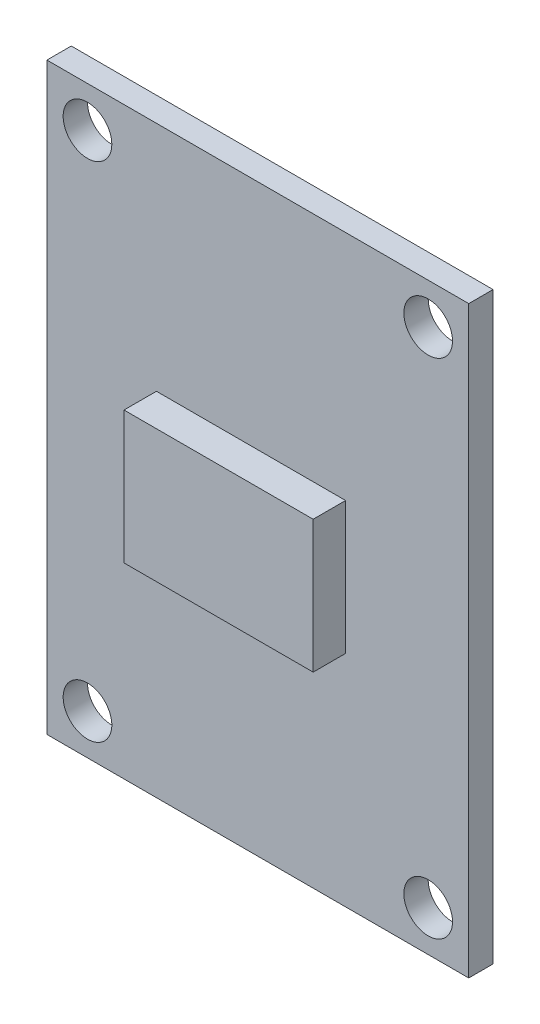
ISO-10303-21;
HEADER;
FILE_DESCRIPTION(('STEP AP214'),'2;1');
FILE_NAME('part.step','',(''),(''),'','','');
FILE_SCHEMA(('AUTOMOTIVE_DESIGN { 1 0 10303 214 1 1 1 1 }'));
ENDSEC;
DATA;
#1=APPLICATION_CONTEXT('core data for automotive mechanical design processes');
#2=APPLICATION_PROTOCOL_DEFINITION('international standard','automotive_design',2000,#1);
#3=PRODUCT_CONTEXT('',#1,'mechanical');
#4=PRODUCT('Part','Part','',(#3));
#5=PRODUCT_RELATED_PRODUCT_CATEGORY('part','',(#4));
#6=PRODUCT_DEFINITION_FORMATION('','',#4);
#7=PRODUCT_DEFINITION_CONTEXT('part definition',#1,'design');
#8=PRODUCT_DEFINITION('design','',#6,#7);
#9=PRODUCT_DEFINITION_SHAPE('','',#8);
#10=(LENGTH_UNIT() NAMED_UNIT(*) SI_UNIT(.MILLI.,.METRE.));
#11=(NAMED_UNIT(*) PLANE_ANGLE_UNIT() SI_UNIT($,.RADIAN.));
#12=(NAMED_UNIT(*) SI_UNIT($,.STERADIAN.) SOLID_ANGLE_UNIT());
#13=UNCERTAINTY_MEASURE_WITH_UNIT(LENGTH_MEASURE(1.E-05),#10,'distance_accuracy_value','');
#14=(GEOMETRIC_REPRESENTATION_CONTEXT(3) GLOBAL_UNCERTAINTY_ASSIGNED_CONTEXT((#13)) GLOBAL_UNIT_ASSIGNED_CONTEXT((#10,
#11,#12)) REPRESENTATION_CONTEXT('',''));
#15=CARTESIAN_POINT('',(0.,0.,0.));
#16=DIRECTION('',(0.,0.,1.));
#17=DIRECTION('',(1.,0.,0.));
#18=AXIS2_PLACEMENT_3D('',#15,#16,#17);
#19=CARTESIAN_POINT('',(0.,0.,1.5));
#20=DIRECTION('',(0.,0.,-1.));
#21=DIRECTION('',(-1.,0.,0.));
#22=AXIS2_PLACEMENT_3D('',#19,#20,#21);
#23=PLANE('',#22);
#24=CARTESIAN_POINT('',(114.872972656904,11.0024836270944,1.5));
#25=DIRECTION('',(0.,0.,1.));
#26=DIRECTION('',(-1.,0.,0.));
#27=AXIS2_PLACEMENT_3D('',#24,#25,#26);
#28=CIRCLE('',#27,1.5);
#29=CARTESIAN_POINT('',(113.372972656904,11.0024836270944,1.5));
#30=VERTEX_POINT('',#29);
#31=EDGE_CURVE('E120',#30,#30,#28,.T.);
#32=ORIENTED_EDGE('',*,*,#31,.F.);
#33=EDGE_LOOP('',(#32));
#34=FACE_BOUND('',#33,.T.);
#35=CARTESIAN_POINT('',(135.872972656904,11.0024836270944,1.5));
#36=DIRECTION('',(0.,0.,1.));
#37=DIRECTION('',(1.,0.,0.));
#38=AXIS2_PLACEMENT_3D('',#35,#36,#37);
#39=CIRCLE('',#38,1.50000000000002);
#40=CARTESIAN_POINT('',(137.372972656904,11.0024836270944,1.5));
#41=VERTEX_POINT('',#40);
#42=EDGE_CURVE('E129',#41,#41,#39,.T.);
#43=ORIENTED_EDGE('',*,*,#42,.F.);
#44=EDGE_LOOP('',(#43));
#45=FACE_BOUND('',#44,.T.);
#46=CARTESIAN_POINT('',(135.872972656904,42.0024836270945,1.5));
#47=DIRECTION('',(0.,0.,1.));
#48=DIRECTION('',(-1.,0.,0.));
#49=AXIS2_PLACEMENT_3D('',#46,#47,#48);
#50=CIRCLE('',#49,1.50000000000002);
#51=CARTESIAN_POINT('',(134.372972656904,42.0024836270945,1.5));
#52=VERTEX_POINT('',#51);
#53=EDGE_CURVE('E135',#52,#52,#50,.T.);
#54=ORIENTED_EDGE('',*,*,#53,.F.);
#55=EDGE_LOOP('',(#54));
#56=FACE_BOUND('',#55,.T.);
#57=CARTESIAN_POINT('',(114.872972656904,42.0024836270945,1.5));
#58=DIRECTION('',(0.,0.,1.));
#59=DIRECTION('',(1.,0.,0.));
#60=AXIS2_PLACEMENT_3D('',#57,#58,#59);
#61=CIRCLE('',#60,1.5);
#62=CARTESIAN_POINT('',(116.372972656904,42.0024836270945,1.5));
#63=VERTEX_POINT('',#62);
#64=EDGE_CURVE('E141',#63,#63,#61,.T.);
#65=ORIENTED_EDGE('',*,*,#64,.F.);
#66=EDGE_LOOP('',(#65));
#67=FACE_BOUND('',#66,.T.);
#68=DIRECTION('',(0.,-1.,0.));
#69=VECTOR('',#68,1.);
#70=CARTESIAN_POINT('',(112.372972656904,8.50248362709445,1.5));
#71=LINE('',#70,#69);
#72=CARTESIAN_POINT('',(112.372972656904,44.5024836270944,1.5));
#73=VERTEX_POINT('',#72);
#74=CARTESIAN_POINT('',(112.372972656904,8.50248362709445,1.5));
#75=VERTEX_POINT('',#74);
#76=EDGE_CURVE('E147',#73,#75,#71,.T.);
#77=ORIENTED_EDGE('',*,*,#76,.T.);
#78=DIRECTION('',(1.,0.,0.));
#79=VECTOR('',#78,1.);
#80=CARTESIAN_POINT('',(112.372972656904,8.50248362709445,1.5));
#81=LINE('',#80,#79);
#82=CARTESIAN_POINT('',(138.372972656904,8.50248362709445,1.5));
#83=VERTEX_POINT('',#82);
#84=EDGE_CURVE('E150',#75,#83,#81,.T.);
#85=ORIENTED_EDGE('',*,*,#84,.T.);
#86=DIRECTION('',(0.,1.,0.));
#87=VECTOR('',#86,1.);
#88=CARTESIAN_POINT('',(138.372972656904,8.50248362709445,1.5));
#89=LINE('',#88,#87);
#90=CARTESIAN_POINT('',(138.372972656904,44.5024836270944,1.5));
#91=VERTEX_POINT('',#90);
#92=EDGE_CURVE('E153',#83,#91,#89,.T.);
#93=ORIENTED_EDGE('',*,*,#92,.T.);
#94=DIRECTION('',(-1.,0.,0.));
#95=VECTOR('',#94,1.);
#96=CARTESIAN_POINT('',(112.372972656904,44.5024836270944,1.5));
#97=LINE('',#96,#95);
#98=EDGE_CURVE('E155',#91,#73,#97,.T.);
#99=ORIENTED_EDGE('',*,*,#98,.T.);
#100=EDGE_LOOP('',(#77,#85,#93,#99));
#101=FACE_BOUND('',#100,.T.);
#102=DIRECTION('',(0.,1.,0.));
#103=VECTOR('',#102,1.);
#104=CARTESIAN_POINT('',(130.783787246229,30.1972816652802,1.5));
#105=LINE('',#104,#103);
#106=CARTESIAN_POINT('',(130.783787246229,22.0352093747583,1.5));
#107=VERTEX_POINT('',#106);
#108=CARTESIAN_POINT('',(130.783787246229,30.1972816652802,1.5));
#109=VERTEX_POINT('',#108);
#110=EDGE_CURVE('E47',#107,#109,#105,.T.);
#111=ORIENTED_EDGE('',*,*,#110,.F.);
#112=DIRECTION('',(1.,0.,0.));
#113=VECTOR('',#112,1.);
#114=CARTESIAN_POINT('',(130.783787246229,22.0352093747583,1.5));
#115=LINE('',#114,#113);
#116=CARTESIAN_POINT('',(119.123683974054,22.0352093747583,1.5));
#117=VERTEX_POINT('',#116);
#118=EDGE_CURVE('E51',#117,#107,#115,.T.);
#119=ORIENTED_EDGE('',*,*,#118,.F.);
#120=DIRECTION('',(0.,-1.,0.));
#121=VECTOR('',#120,1.);
#122=CARTESIAN_POINT('',(119.123683974054,30.1972816652802,1.5));
#123=LINE('',#122,#121);
#124=CARTESIAN_POINT('',(119.123683974054,30.1972816652802,1.5));
#125=VERTEX_POINT('',#124);
#126=EDGE_CURVE('E334',#125,#117,#123,.T.);
#127=ORIENTED_EDGE('',*,*,#126,.F.);
#128=DIRECTION('',(-1.,0.,0.));
#129=VECTOR('',#128,1.);
#130=CARTESIAN_POINT('',(130.783787246229,30.1972816652802,1.5));
#131=LINE('',#130,#129);
#132=EDGE_CURVE('E340',#109,#125,#131,.T.);
#133=ORIENTED_EDGE('',*,*,#132,.F.);
#134=EDGE_LOOP('',(#111,#119,#127,#133));
#135=FACE_BOUND('',#134,.T.);
#136=ADVANCED_FACE('F32',(#34,#45,#56,#67,#101,#135),#23,.F.);
#137=CARTESIAN_POINT('',(0.,0.,0.));
#138=DIRECTION('',(0.,0.,-1.));
#139=DIRECTION('',(-1.,0.,0.));
#140=AXIS2_PLACEMENT_3D('',#137,#138,#139);
#141=PLANE('',#140);
#142=CARTESIAN_POINT('',(135.872972656904,11.0024836270944,0.));
#143=DIRECTION('',(0.,0.,1.));
#144=DIRECTION('',(1.,0.,0.));
#145=AXIS2_PLACEMENT_3D('',#142,#143,#144);
#146=CIRCLE('',#145,1.50000000000002);
#147=CARTESIAN_POINT('',(137.372972656904,11.0024836270944,0.));
#148=VERTEX_POINT('',#147);
#149=EDGE_CURVE('E127',#148,#148,#146,.T.);
#150=ORIENTED_EDGE('',*,*,#149,.T.);
#151=EDGE_LOOP('',(#150));
#152=FACE_BOUND('',#151,.T.);
#153=CARTESIAN_POINT('',(114.872972656904,42.0024836270945,0.));
#154=DIRECTION('',(0.,0.,1.));
#155=DIRECTION('',(1.,0.,0.));
#156=AXIS2_PLACEMENT_3D('',#153,#154,#155);
#157=CIRCLE('',#156,1.5);
#158=CARTESIAN_POINT('',(116.372972656904,42.0024836270945,0.));
#159=VERTEX_POINT('',#158);
#160=EDGE_CURVE('E138',#159,#159,#157,.T.);
#161=ORIENTED_EDGE('',*,*,#160,.T.);
#162=EDGE_LOOP('',(#161));
#163=FACE_BOUND('',#162,.T.);
#164=DIRECTION('',(0.,-1.,0.));
#165=VECTOR('',#164,1.);
#166=CARTESIAN_POINT('',(112.372972656904,8.50248362709445,0.));
#167=LINE('',#166,#165);
#168=CARTESIAN_POINT('',(112.372972656904,44.5024836270944,0.));
#169=VERTEX_POINT('',#168);
#170=CARTESIAN_POINT('',(112.372972656904,8.50248362709445,0.));
#171=VERTEX_POINT('',#170);
#172=EDGE_CURVE('E144',#169,#171,#167,.T.);
#173=ORIENTED_EDGE('',*,*,#172,.F.);
#174=DIRECTION('',(-1.,0.,0.));
#175=VECTOR('',#174,1.);
#176=CARTESIAN_POINT('',(112.372972656904,44.5024836270944,0.));
#177=LINE('',#176,#175);
#178=CARTESIAN_POINT('',(138.372972656904,44.5024836270944,0.));
#179=VERTEX_POINT('',#178);
#180=EDGE_CURVE('E151',#179,#169,#177,.T.);
#181=ORIENTED_EDGE('',*,*,#180,.F.);
#182=DIRECTION('',(0.,1.,0.));
#183=VECTOR('',#182,1.);
#184=CARTESIAN_POINT('',(138.372972656904,8.50248362709445,0.));
#185=LINE('',#184,#183);
#186=CARTESIAN_POINT('',(138.372972656904,8.50248362709445,0.));
#187=VERTEX_POINT('',#186);
#188=EDGE_CURVE('E162',#187,#179,#185,.T.);
#189=ORIENTED_EDGE('',*,*,#188,.F.);
#190=DIRECTION('',(1.,0.,0.));
#191=VECTOR('',#190,1.);
#192=CARTESIAN_POINT('',(112.372972656904,8.50248362709445,0.));
#193=LINE('',#192,#191);
#194=EDGE_CURVE('E160',#171,#187,#193,.T.);
#195=ORIENTED_EDGE('',*,*,#194,.F.);
#196=EDGE_LOOP('',(#173,#181,#189,#195));
#197=FACE_BOUND('',#196,.T.);
#198=CARTESIAN_POINT('',(135.872972656904,42.0024836270945,0.));
#199=DIRECTION('',(0.,0.,1.));
#200=DIRECTION('',(-1.,0.,0.));
#201=AXIS2_PLACEMENT_3D('',#198,#199,#200);
#202=CIRCLE('',#201,1.50000000000002);
#203=CARTESIAN_POINT('',(134.372972656904,42.0024836270945,0.));
#204=VERTEX_POINT('',#203);
#205=EDGE_CURVE('E132',#204,#204,#202,.T.);
#206=ORIENTED_EDGE('',*,*,#205,.T.);
#207=EDGE_LOOP('',(#206));
#208=FACE_BOUND('',#207,.T.);
#209=CARTESIAN_POINT('',(114.872972656904,11.0024836270944,0.));
#210=DIRECTION('',(0.,0.,1.));
#211=DIRECTION('',(-1.,0.,0.));
#212=AXIS2_PLACEMENT_3D('',#209,#210,#211);
#213=CIRCLE('',#212,1.5);
#214=CARTESIAN_POINT('',(113.372972656904,11.0024836270944,0.));
#215=VERTEX_POINT('',#214);
#216=EDGE_CURVE('E117',#215,#215,#213,.T.);
#217=ORIENTED_EDGE('',*,*,#216,.T.);
#218=EDGE_LOOP('',(#217));
#219=FACE_BOUND('',#218,.T.);
#220=ADVANCED_FACE('F180',(#152,#163,#197,#208,#219),#141,.T.);
#221=CARTESIAN_POINT('',(112.372972656904,8.50248362709445,1.5));
#222=DIRECTION('',(1.,0.,0.));
#223=DIRECTION('',(0.,1.,0.));
#224=AXIS2_PLACEMENT_3D('',#221,#222,#223);
#225=PLANE('',#224);
#226=ORIENTED_EDGE('',*,*,#172,.T.);
#227=DIRECTION('',(0.,0.,-1.));
#228=VECTOR('',#227,1.);
#229=CARTESIAN_POINT('',(112.372972656904,8.50248362709445,1.5));
#230=LINE('',#229,#228);
#231=EDGE_CURVE('E11',#75,#171,#230,.T.);
#232=ORIENTED_EDGE('',*,*,#231,.F.);
#233=ORIENTED_EDGE('',*,*,#76,.F.);
#234=DIRECTION('',(0.,0.,-1.));
#235=VECTOR('',#234,1.);
#236=CARTESIAN_POINT('',(112.372972656904,44.5024836270944,1.5));
#237=LINE('',#236,#235);
#238=EDGE_CURVE('E157',#73,#169,#237,.T.);
#239=ORIENTED_EDGE('',*,*,#238,.T.);
#240=EDGE_LOOP('',(#226,#232,#233,#239));
#241=FACE_BOUND('',#240,.T.);
#242=ADVANCED_FACE('F34',(#241),#225,.F.);
#243=CARTESIAN_POINT('',(112.372972656904,8.50248362709445,1.5));
#244=DIRECTION('',(0.,1.,0.));
#245=DIRECTION('',(0.,0.,1.));
#246=AXIS2_PLACEMENT_3D('',#243,#244,#245);
#247=PLANE('',#246);
#248=ORIENTED_EDGE('',*,*,#194,.T.);
#249=DIRECTION('',(0.,0.,-1.));
#250=VECTOR('',#249,1.);
#251=CARTESIAN_POINT('',(138.372972656904,8.50248362709445,1.5));
#252=LINE('',#251,#250);
#253=EDGE_CURVE('E40',#83,#187,#252,.T.);
#254=ORIENTED_EDGE('',*,*,#253,.F.);
#255=ORIENTED_EDGE('',*,*,#84,.F.);
#256=ORIENTED_EDGE('',*,*,#231,.T.);
#257=EDGE_LOOP('',(#248,#254,#255,#256));
#258=FACE_BOUND('',#257,.T.);
#259=ADVANCED_FACE('F190',(#258),#247,.F.);
#260=CARTESIAN_POINT('',(138.372972656904,8.50248362709445,1.5));
#261=DIRECTION('',(-1.,0.,0.));
#262=DIRECTION('',(0.,-1.,0.));
#263=AXIS2_PLACEMENT_3D('',#260,#261,#262);
#264=PLANE('',#263);
#265=ORIENTED_EDGE('',*,*,#188,.T.);
#266=DIRECTION('',(0.,0.,-1.));
#267=VECTOR('',#266,1.);
#268=CARTESIAN_POINT('',(138.372972656904,44.5024836270944,1.5));
#269=LINE('',#268,#267);
#270=EDGE_CURVE('E167',#91,#179,#269,.T.);
#271=ORIENTED_EDGE('',*,*,#270,.F.);
#272=ORIENTED_EDGE('',*,*,#92,.F.);
#273=ORIENTED_EDGE('',*,*,#253,.T.);
#274=EDGE_LOOP('',(#265,#271,#272,#273));
#275=FACE_BOUND('',#274,.T.);
#276=ADVANCED_FACE('F174',(#275),#264,.F.);
#277=CARTESIAN_POINT('',(112.372972656904,44.5024836270944,1.5));
#278=DIRECTION('',(0.,-1.,0.));
#279=DIRECTION('',(0.,0.,-1.));
#280=AXIS2_PLACEMENT_3D('',#277,#278,#279);
#281=PLANE('',#280);
#282=ORIENTED_EDGE('',*,*,#180,.T.);
#283=ORIENTED_EDGE('',*,*,#238,.F.);
#284=ORIENTED_EDGE('',*,*,#98,.F.);
#285=ORIENTED_EDGE('',*,*,#270,.T.);
#286=EDGE_LOOP('',(#282,#283,#284,#285));
#287=FACE_BOUND('',#286,.T.);
#288=ADVANCED_FACE('F184',(#287),#281,.F.);
#289=CARTESIAN_POINT('',(114.872972656904,42.0024836270945,1.5));
#290=DIRECTION('',(0.,0.,-1.));
#291=DIRECTION('',(-1.,0.,0.));
#292=AXIS2_PLACEMENT_3D('',#289,#290,#291);
#293=CYLINDRICAL_SURFACE('',#292,1.5);
#294=ORIENTED_EDGE('',*,*,#64,.T.);
#295=EDGE_LOOP('',(#294));
#296=FACE_BOUND('',#295,.T.);
#297=ORIENTED_EDGE('',*,*,#160,.F.);
#298=EDGE_LOOP('',(#297));
#299=FACE_BOUND('',#298,.T.);
#300=ADVANCED_FACE('F208',(#296,#299),#293,.F.);
#301=CARTESIAN_POINT('',(135.872972656904,42.0024836270945,1.5));
#302=DIRECTION('',(0.,0.,-1.));
#303=DIRECTION('',(-1.,0.,0.));
#304=AXIS2_PLACEMENT_3D('',#301,#302,#303);
#305=CYLINDRICAL_SURFACE('',#304,1.50000000000002);
#306=ORIENTED_EDGE('',*,*,#53,.T.);
#307=EDGE_LOOP('',(#306));
#308=FACE_BOUND('',#307,.T.);
#309=ORIENTED_EDGE('',*,*,#205,.F.);
#310=EDGE_LOOP('',(#309));
#311=FACE_BOUND('',#310,.T.);
#312=ADVANCED_FACE('F215',(#308,#311),#305,.F.);
#313=CARTESIAN_POINT('',(135.872972656904,11.0024836270944,1.5));
#314=DIRECTION('',(0.,0.,-1.));
#315=DIRECTION('',(-1.,0.,0.));
#316=AXIS2_PLACEMENT_3D('',#313,#314,#315);
#317=CYLINDRICAL_SURFACE('',#316,1.50000000000002);
#318=ORIENTED_EDGE('',*,*,#42,.T.);
#319=EDGE_LOOP('',(#318));
#320=FACE_BOUND('',#319,.T.);
#321=ORIENTED_EDGE('',*,*,#149,.F.);
#322=EDGE_LOOP('',(#321));
#323=FACE_BOUND('',#322,.T.);
#324=ADVANCED_FACE('F220',(#320,#323),#317,.F.);
#325=CARTESIAN_POINT('',(114.872972656904,11.0024836270944,1.5));
#326=DIRECTION('',(0.,0.,-1.));
#327=DIRECTION('',(-1.,0.,0.));
#328=AXIS2_PLACEMENT_3D('',#325,#326,#327);
#329=CYLINDRICAL_SURFACE('',#328,1.5);
#330=ORIENTED_EDGE('',*,*,#31,.T.);
#331=EDGE_LOOP('',(#330));
#332=FACE_BOUND('',#331,.T.);
#333=ORIENTED_EDGE('',*,*,#216,.F.);
#334=EDGE_LOOP('',(#333));
#335=FACE_BOUND('',#334,.T.);
#336=ADVANCED_FACE('F230',(#332,#335),#329,.F.);
#337=CARTESIAN_POINT('',(130.783787246229,30.1972816652802,3.5));
#338=DIRECTION('',(-1.,0.,0.));
#339=DIRECTION('',(0.,0.,1.));
#340=AXIS2_PLACEMENT_3D('',#337,#338,#339);
#341=PLANE('',#340);
#342=ORIENTED_EDGE('',*,*,#110,.T.);
#343=DIRECTION('',(0.,0.,-1.));
#344=VECTOR('',#343,1.);
#345=CARTESIAN_POINT('',(130.783787246229,30.1972816652802,3.5));
#346=LINE('',#345,#344);
#347=CARTESIAN_POINT('',(130.783787246229,30.1972816652802,3.5));
#348=VERTEX_POINT('',#347);
#349=EDGE_CURVE('E100',#348,#109,#346,.T.);
#350=ORIENTED_EDGE('',*,*,#349,.F.);
#351=DIRECTION('',(0.,1.,0.));
#352=VECTOR('',#351,1.);
#353=CARTESIAN_POINT('',(130.783787246229,30.1972816652802,3.5));
#354=LINE('',#353,#352);
#355=CARTESIAN_POINT('',(130.783787246229,22.0352093747583,3.5));
#356=VERTEX_POINT('',#355);
#357=EDGE_CURVE('E106',#356,#348,#354,.T.);
#358=ORIENTED_EDGE('',*,*,#357,.F.);
#359=DIRECTION('',(0.,0.,-1.));
#360=VECTOR('',#359,1.);
#361=CARTESIAN_POINT('',(130.783787246229,22.0352093747583,3.5));
#362=LINE('',#361,#360);
#363=EDGE_CURVE('E332',#356,#107,#362,.T.);
#364=ORIENTED_EDGE('',*,*,#363,.T.);
#365=EDGE_LOOP('',(#342,#350,#358,#364));
#366=FACE_BOUND('',#365,.T.);
#367=ADVANCED_FACE('F116',(#366),#341,.F.);
#368=CARTESIAN_POINT('',(130.783787246229,30.1972816652802,3.5));
#369=DIRECTION('',(0.,-1.,0.));
#370=DIRECTION('',(0.,0.,-1.));
#371=AXIS2_PLACEMENT_3D('',#368,#369,#370);
#372=PLANE('',#371);
#373=ORIENTED_EDGE('',*,*,#132,.T.);
#374=DIRECTION('',(0.,0.,-1.));
#375=VECTOR('',#374,1.);
#376=CARTESIAN_POINT('',(119.123683974054,30.1972816652802,3.5));
#377=LINE('',#376,#375);
#378=CARTESIAN_POINT('',(119.123683974054,30.1972816652802,3.5));
#379=VERTEX_POINT('',#378);
#380=EDGE_CURVE('E102',#379,#125,#377,.T.);
#381=ORIENTED_EDGE('',*,*,#380,.F.);
#382=DIRECTION('',(-1.,0.,0.));
#383=VECTOR('',#382,1.);
#384=CARTESIAN_POINT('',(130.783787246229,30.1972816652802,3.5));
#385=LINE('',#384,#383);
#386=EDGE_CURVE('E95',#348,#379,#385,.T.);
#387=ORIENTED_EDGE('',*,*,#386,.F.);
#388=ORIENTED_EDGE('',*,*,#349,.T.);
#389=EDGE_LOOP('',(#373,#381,#387,#388));
#390=FACE_BOUND('',#389,.T.);
#391=ADVANCED_FACE('F98',(#390),#372,.F.);
#392=CARTESIAN_POINT('',(119.123683974054,30.1972816652802,3.5));
#393=DIRECTION('',(1.,0.,0.));
#394=DIRECTION('',(0.,0.,-1.));
#395=AXIS2_PLACEMENT_3D('',#392,#393,#394);
#396=PLANE('',#395);
#397=ORIENTED_EDGE('',*,*,#126,.T.);
#398=DIRECTION('',(0.,0.,-1.));
#399=VECTOR('',#398,1.);
#400=CARTESIAN_POINT('',(119.123683974054,22.0352093747583,3.5));
#401=LINE('',#400,#399);
#402=CARTESIAN_POINT('',(119.123683974054,22.0352093747583,3.5));
#403=VERTEX_POINT('',#402);
#404=EDGE_CURVE('E122',#403,#117,#401,.T.);
#405=ORIENTED_EDGE('',*,*,#404,.F.);
#406=DIRECTION('',(0.,-1.,0.));
#407=VECTOR('',#406,1.);
#408=CARTESIAN_POINT('',(119.123683974054,30.1972816652802,3.5));
#409=LINE('',#408,#407);
#410=EDGE_CURVE('E105',#379,#403,#409,.T.);
#411=ORIENTED_EDGE('',*,*,#410,.F.);
#412=ORIENTED_EDGE('',*,*,#380,.T.);
#413=EDGE_LOOP('',(#397,#405,#411,#412));
#414=FACE_BOUND('',#413,.T.);
#415=ADVANCED_FACE('F242',(#414),#396,.F.);
#416=CARTESIAN_POINT('',(130.783787246229,22.0352093747583,3.5));
#417=DIRECTION('',(0.,1.,0.));
#418=DIRECTION('',(0.,0.,1.));
#419=AXIS2_PLACEMENT_3D('',#416,#417,#418);
#420=PLANE('',#419);
#421=ORIENTED_EDGE('',*,*,#118,.T.);
#422=ORIENTED_EDGE('',*,*,#363,.F.);
#423=DIRECTION('',(1.,0.,0.));
#424=VECTOR('',#423,1.);
#425=CARTESIAN_POINT('',(130.783787246229,22.0352093747583,3.5));
#426=LINE('',#425,#424);
#427=EDGE_CURVE('E111',#403,#356,#426,.T.);
#428=ORIENTED_EDGE('',*,*,#427,.F.);
#429=ORIENTED_EDGE('',*,*,#404,.T.);
#430=EDGE_LOOP('',(#421,#422,#428,#429));
#431=FACE_BOUND('',#430,.T.);
#432=ADVANCED_FACE('F245',(#431),#420,.F.);
#433=CARTESIAN_POINT('',(0.,0.,3.5));
#434=DIRECTION('',(0.,0.,-1.));
#435=DIRECTION('',(-1.,0.,0.));
#436=AXIS2_PLACEMENT_3D('',#433,#434,#435);
#437=PLANE('',#436);
#438=ORIENTED_EDGE('',*,*,#357,.T.);
#439=ORIENTED_EDGE('',*,*,#386,.T.);
#440=ORIENTED_EDGE('',*,*,#410,.T.);
#441=ORIENTED_EDGE('',*,*,#427,.T.);
#442=EDGE_LOOP('',(#438,#439,#440,#441));
#443=FACE_BOUND('',#442,.T.);
#444=ADVANCED_FACE('F109',(#443),#437,.F.);
#445=CLOSED_SHELL('',(#136,#220,#242,#259,#276,#288,#300,#312,#324,#336,#367,#391,#415,#432,#444));
#446=MANIFOLD_SOLID_BREP('B2',#445);
#447=ADVANCED_BREP_SHAPE_REPRESENTATION('',(#18,#446),#14);
#448=SHAPE_DEFINITION_REPRESENTATION(#9,#447);
ENDSEC;
END-ISO-10303-21;
